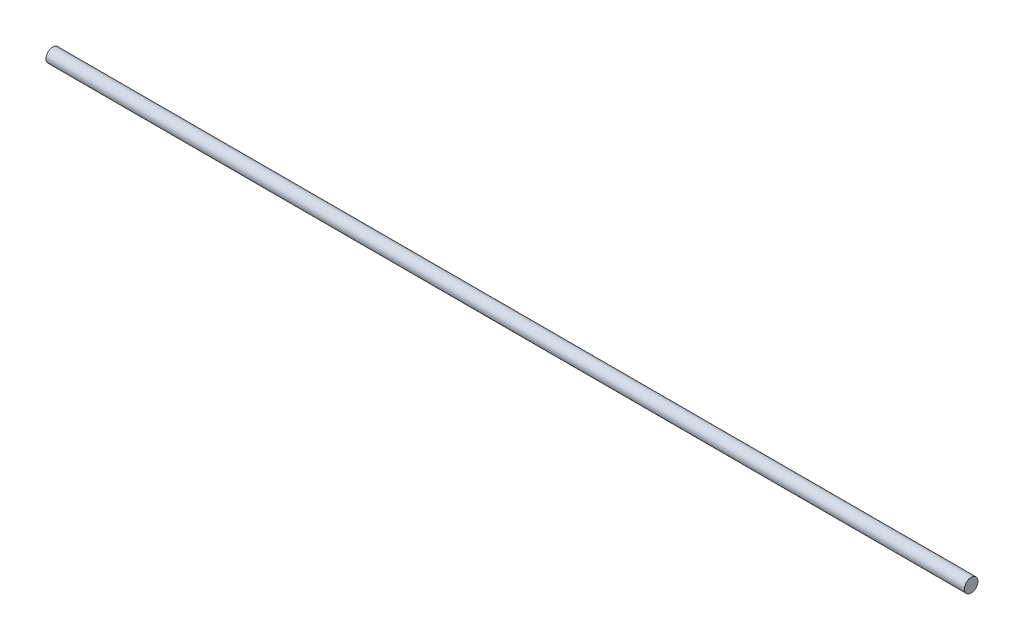
ISO-10303-21;
HEADER;
FILE_DESCRIPTION(('STEP AP214'),'2;1');
FILE_NAME('part.step','',(''),(''),'','','');
FILE_SCHEMA(('AUTOMOTIVE_DESIGN { 1 0 10303 214 1 1 1 1 }'));
ENDSEC;
DATA;
#1=APPLICATION_CONTEXT('core data for automotive mechanical design processes');
#2=APPLICATION_PROTOCOL_DEFINITION('international standard','automotive_design',2000,#1);
#3=PRODUCT_CONTEXT('',#1,'mechanical');
#4=PRODUCT('Part','Part','',(#3));
#5=PRODUCT_RELATED_PRODUCT_CATEGORY('part','',(#4));
#6=PRODUCT_DEFINITION_FORMATION('','',#4);
#7=PRODUCT_DEFINITION_CONTEXT('part definition',#1,'design');
#8=PRODUCT_DEFINITION('design','',#6,#7);
#9=PRODUCT_DEFINITION_SHAPE('','',#8);
#10=(LENGTH_UNIT() NAMED_UNIT(*) SI_UNIT(.MILLI.,.METRE.));
#11=(NAMED_UNIT(*) PLANE_ANGLE_UNIT() SI_UNIT($,.RADIAN.));
#12=(NAMED_UNIT(*) SI_UNIT($,.STERADIAN.) SOLID_ANGLE_UNIT());
#13=UNCERTAINTY_MEASURE_WITH_UNIT(LENGTH_MEASURE(1.E-05),#10,'distance_accuracy_value','');
#14=(GEOMETRIC_REPRESENTATION_CONTEXT(3) GLOBAL_UNCERTAINTY_ASSIGNED_CONTEXT((#13)) GLOBAL_UNIT_ASSIGNED_CONTEXT((#10,
#11,#12)) REPRESENTATION_CONTEXT('',''));
#15=CARTESIAN_POINT('',(0.,0.,0.));
#16=DIRECTION('',(0.,0.,1.));
#17=DIRECTION('',(1.,0.,0.));
#18=AXIS2_PLACEMENT_3D('',#15,#16,#17);
#19=CARTESIAN_POINT('',(267.617866820065,2.72965119211221,-0.347074403293846));
#20=DIRECTION('',(-1.,0.,0.));
#21=DIRECTION('',(0.,0.,1.));
#22=AXIS2_PLACEMENT_3D('',#19,#20,#21);
#23=CYLINDRICAL_SURFACE('',#22,4.);
#24=CARTESIAN_POINT('',(267.617866820065,2.72965119211221,-0.347074403293846));
#25=DIRECTION('',(1.,0.,0.));
#26=DIRECTION('',(0.,0.,-1.));
#27=AXIS2_PLACEMENT_3D('',#24,#25,#26);
#28=CIRCLE('',#27,4.);
#29=CARTESIAN_POINT('',(267.617866820065,2.72965119211221,-4.34707440329385));
#30=VERTEX_POINT('',#29);
#31=EDGE_CURVE('E9',#30,#30,#28,.T.);
#32=ORIENTED_EDGE('',*,*,#31,.F.);
#33=EDGE_LOOP('',(#32));
#34=FACE_BOUND('',#33,.T.);
#35=CARTESIAN_POINT('',(-272.382133179935,2.72965119211221,-0.347074403293846));
#36=DIRECTION('',(1.,0.,0.));
#37=DIRECTION('',(0.,0.,-1.));
#38=AXIS2_PLACEMENT_3D('',#35,#36,#37);
#39=CIRCLE('',#38,4.);
#40=CARTESIAN_POINT('',(-272.382133179935,2.72965119211221,-4.34707440329385));
#41=VERTEX_POINT('',#40);
#42=EDGE_CURVE('E17',#41,#41,#39,.T.);
#43=ORIENTED_EDGE('',*,*,#42,.T.);
#44=EDGE_LOOP('',(#43));
#45=FACE_BOUND('',#44,.T.);
#46=ADVANCED_FACE('F14',(#34,#45),#23,.T.);
#47=CARTESIAN_POINT('',(267.617866820065,2.72965119211221,-0.347074403293846));
#48=DIRECTION('',(1.,0.,0.));
#49=DIRECTION('',(0.,0.,-1.));
#50=AXIS2_PLACEMENT_3D('',#47,#48,#49);
#51=PLANE('',#50);
#52=ORIENTED_EDGE('',*,*,#31,.T.);
#53=EDGE_LOOP('',(#52));
#54=FACE_BOUND('',#53,.T.);
#55=ADVANCED_FACE('F29',(#54),#51,.T.);
#56=CARTESIAN_POINT('',(-272.382133179935,2.72965119211221,-0.347074403293846));
#57=DIRECTION('',(1.,0.,0.));
#58=DIRECTION('',(0.,0.,-1.));
#59=AXIS2_PLACEMENT_3D('',#56,#57,#58);
#60=PLANE('',#59);
#61=ORIENTED_EDGE('',*,*,#42,.F.);
#62=EDGE_LOOP('',(#61));
#63=FACE_BOUND('',#62,.T.);
#64=ADVANCED_FACE('F27',(#63),#60,.F.);
#65=CLOSED_SHELL('',(#46,#55,#64));
#66=MANIFOLD_SOLID_BREP('B1',#65);
#67=ADVANCED_BREP_SHAPE_REPRESENTATION('',(#18,#66),#14);
#68=SHAPE_DEFINITION_REPRESENTATION(#9,#67);
ENDSEC;
END-ISO-10303-21;
